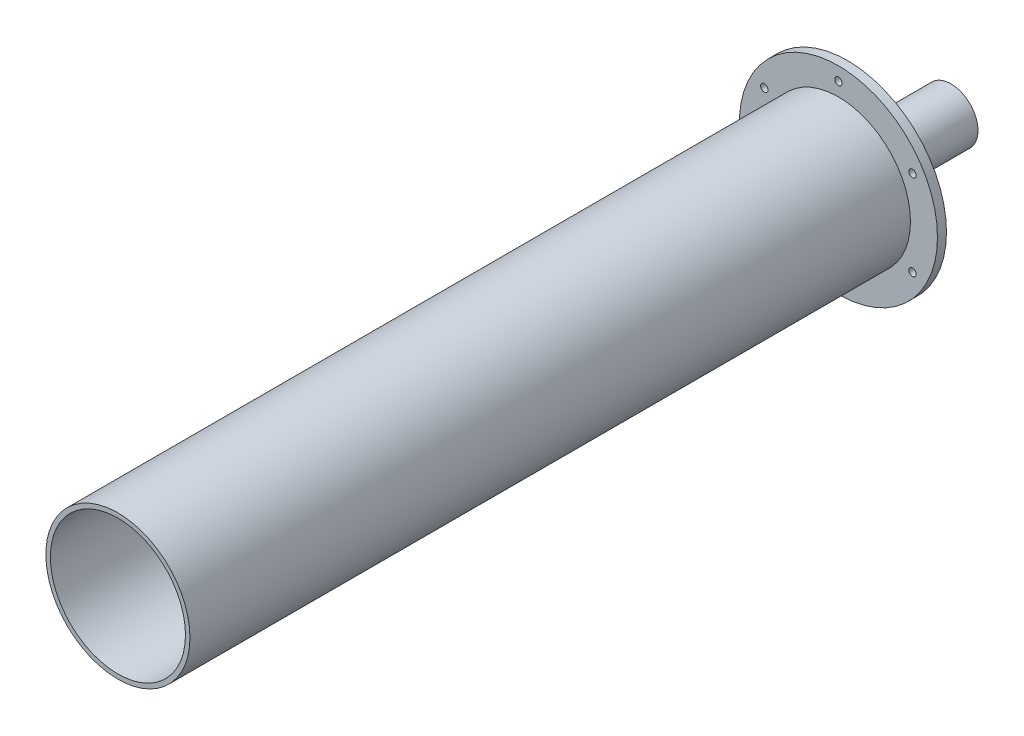
ISO-10303-21;
HEADER;
FILE_DESCRIPTION(('STEP AP214'),'2;1');
FILE_NAME('part.step','',(''),(''),'','','');
FILE_SCHEMA(('AUTOMOTIVE_DESIGN { 1 0 10303 214 1 1 1 1 }'));
ENDSEC;
DATA;
#1=APPLICATION_CONTEXT('core data for automotive mechanical design processes');
#2=APPLICATION_PROTOCOL_DEFINITION('international standard','automotive_design',2000,#1);
#3=PRODUCT_CONTEXT('',#1,'mechanical');
#4=PRODUCT('Part','Part','',(#3));
#5=PRODUCT_RELATED_PRODUCT_CATEGORY('part','',(#4));
#6=PRODUCT_DEFINITION_FORMATION('','',#4);
#7=PRODUCT_DEFINITION_CONTEXT('part definition',#1,'design');
#8=PRODUCT_DEFINITION('design','',#6,#7);
#9=PRODUCT_DEFINITION_SHAPE('','',#8);
#10=(LENGTH_UNIT() NAMED_UNIT(*) SI_UNIT(.MILLI.,.METRE.));
#11=(NAMED_UNIT(*) PLANE_ANGLE_UNIT() SI_UNIT($,.RADIAN.));
#12=(NAMED_UNIT(*) SI_UNIT($,.STERADIAN.) SOLID_ANGLE_UNIT());
#13=UNCERTAINTY_MEASURE_WITH_UNIT(LENGTH_MEASURE(1.E-05),#10,'distance_accuracy_value','');
#14=(GEOMETRIC_REPRESENTATION_CONTEXT(3) GLOBAL_UNCERTAINTY_ASSIGNED_CONTEXT((#13)) GLOBAL_UNIT_ASSIGNED_CONTEXT((#10,
#11,#12)) REPRESENTATION_CONTEXT('',''));
#15=CARTESIAN_POINT('',(0.,0.,0.));
#16=DIRECTION('',(0.,0.,1.));
#17=DIRECTION('',(1.,0.,0.));
#18=AXIS2_PLACEMENT_3D('',#15,#16,#17);
#19=CARTESIAN_POINT('',(0.,-153.811421356237,0.));
#20=DIRECTION('',(0.,0.,1.));
#21=DIRECTION('',(1.,0.,0.));
#22=AXIS2_PLACEMENT_3D('',#19,#20,#21);
#23=PLANE('',#22);
#24=CARTESIAN_POINT('',(-52.2429824832965,-30.1624999999995,0.));
#25=DIRECTION('',(0.,0.,1.));
#26=DIRECTION('',(-0.499999999999992,0.866025403784443,0.));
#27=AXIS2_PLACEMENT_3D('',#24,#25,#26);
#28=CIRCLE('',#27,2.5796875);
#29=CARTESIAN_POINT('',(-53.5328262332965,-27.9284250911743,0.));
#30=VERTEX_POINT('',#29);
#31=EDGE_CURVE('E432',#30,#30,#28,.T.);
#32=ORIENTED_EDGE('',*,*,#31,.T.);
#33=EDGE_LOOP('',(#32));
#34=FACE_BOUND('',#33,.T.);
#35=CARTESIAN_POINT('',(52.2429824832961,-30.1625000000002,0.));
#36=DIRECTION('',(0.,0.,1.));
#37=DIRECTION('',(-0.500000000000004,-0.866025403784436,0.));
#38=AXIS2_PLACEMENT_3D('',#35,#36,#37);
#39=CIRCLE('',#38,2.5796875);
#40=CARTESIAN_POINT('',(50.9531387332961,-32.3965749088254,0.));
#41=VERTEX_POINT('',#40);
#42=EDGE_CURVE('E420',#41,#41,#39,.T.);
#43=ORIENTED_EDGE('',*,*,#42,.T.);
#44=EDGE_LOOP('',(#43));
#45=FACE_BOUND('',#44,.T.);
#46=CARTESIAN_POINT('',(0.,60.325,0.));
#47=DIRECTION('',(0.,0.,1.));
#48=DIRECTION('',(1.,0.,0.));
#49=AXIS2_PLACEMENT_3D('',#46,#47,#48);
#50=CIRCLE('',#49,2.5796875);
#51=CARTESIAN_POINT('',(2.5796875,60.325,0.));
#52=VERTEX_POINT('',#51);
#53=EDGE_CURVE('E408',#52,#52,#50,.T.);
#54=ORIENTED_EDGE('',*,*,#53,.T.);
#55=EDGE_LOOP('',(#54));
#56=FACE_BOUND('',#55,.T.);
#57=CARTESIAN_POINT('',(0.,0.,0.));
#58=DIRECTION('',(0.,0.,1.));
#59=DIRECTION('',(1.,0.,0.));
#60=AXIS2_PLACEMENT_3D('',#57,#58,#59);
#61=CIRCLE('',#60,69.85);
#62=CARTESIAN_POINT('',(69.85,0.,0.));
#63=VERTEX_POINT('',#62);
#64=EDGE_CURVE('E390',#63,#63,#61,.T.);
#65=ORIENTED_EDGE('',*,*,#64,.F.);
#66=EDGE_LOOP('',(#65));
#67=FACE_BOUND('',#66,.T.);
#68=CARTESIAN_POINT('',(0.,0.,0.));
#69=DIRECTION('',(0.,0.,1.));
#70=DIRECTION('',(1.,0.,0.));
#71=AXIS2_PLACEMENT_3D('',#68,#69,#70);
#72=CIRCLE('',#71,50.8);
#73=CARTESIAN_POINT('',(50.8,0.,0.));
#74=VERTEX_POINT('',#73);
#75=EDGE_CURVE('E399',#74,#74,#72,.T.);
#76=ORIENTED_EDGE('',*,*,#75,.T.);
#77=EDGE_LOOP('',(#76));
#78=FACE_BOUND('',#77,.T.);
#79=CARTESIAN_POINT('',(52.2429824832963,30.1624999999999,0.));
#80=DIRECTION('',(0.,0.,1.));
#81=DIRECTION('',(0.499999999999998,-0.86602540378444,0.));
#82=AXIS2_PLACEMENT_3D('',#79,#80,#81);
#83=CIRCLE('',#82,2.5796875);
#84=CARTESIAN_POINT('',(53.5328262332963,27.9284250911747,0.));
#85=VERTEX_POINT('',#84);
#86=EDGE_CURVE('E414',#85,#85,#83,.T.);
#87=ORIENTED_EDGE('',*,*,#86,.T.);
#88=EDGE_LOOP('',(#87));
#89=FACE_BOUND('',#88,.T.);
#90=CARTESIAN_POINT('',(-4.21247467517847E-13,-60.325,0.));
#91=DIRECTION('',(0.,0.,1.));
#92=DIRECTION('',(-1.,0.,0.));
#93=AXIS2_PLACEMENT_3D('',#90,#91,#92);
#94=CIRCLE('',#93,2.5796875);
#95=CARTESIAN_POINT('',(-2.57968750000042,-60.325,0.));
#96=VERTEX_POINT('',#95);
#97=EDGE_CURVE('E426',#96,#96,#94,.T.);
#98=ORIENTED_EDGE('',*,*,#97,.T.);
#99=EDGE_LOOP('',(#98));
#100=FACE_BOUND('',#99,.T.);
#101=CARTESIAN_POINT('',(-52.2429824832959,30.1625000000006,0.));
#102=DIRECTION('',(0.,0.,1.));
#103=DIRECTION('',(0.50000000000001,0.866025403784433,0.));
#104=AXIS2_PLACEMENT_3D('',#101,#102,#103);
#105=CIRCLE('',#104,2.5796875);
#106=CARTESIAN_POINT('',(-50.9531387332959,32.3965749088258,0.));
#107=VERTEX_POINT('',#106);
#108=EDGE_CURVE('E438',#107,#107,#105,.T.);
#109=ORIENTED_EDGE('',*,*,#108,.T.);
#110=EDGE_LOOP('',(#109));
#111=FACE_BOUND('',#110,.T.);
#112=ADVANCED_FACE('F364',(#34,#45,#56,#67,#78,#89,#100,#111),#23,.F.);
#113=CARTESIAN_POINT('',(0.,-153.811421356237,6.35));
#114=DIRECTION('',(0.,0.,1.));
#115=DIRECTION('',(1.,0.,0.));
#116=AXIS2_PLACEMENT_3D('',#113,#114,#115);
#117=PLANE('',#116);
#118=CARTESIAN_POINT('',(-52.2429824832965,-30.1624999999995,6.35));
#119=DIRECTION('',(0.,0.,1.));
#120=DIRECTION('',(1.,0.,0.));
#121=AXIS2_PLACEMENT_3D('',#118,#119,#120);
#122=CIRCLE('',#121,2.5796875);
#123=CARTESIAN_POINT('',(-49.6632949832965,-30.1624999999995,6.35));
#124=VERTEX_POINT('',#123);
#125=EDGE_CURVE('E429',#124,#124,#122,.T.);
#126=ORIENTED_EDGE('',*,*,#125,.F.);
#127=EDGE_LOOP('',(#126));
#128=FACE_BOUND('',#127,.T.);
#129=CARTESIAN_POINT('',(52.2429824832961,-30.1625000000002,6.35));
#130=DIRECTION('',(0.,0.,1.));
#131=DIRECTION('',(1.,0.,0.));
#132=AXIS2_PLACEMENT_3D('',#129,#130,#131);
#133=CIRCLE('',#132,2.5796875);
#134=CARTESIAN_POINT('',(54.8226699832961,-30.1625000000002,6.35));
#135=VERTEX_POINT('',#134);
#136=EDGE_CURVE('E417',#135,#135,#133,.T.);
#137=ORIENTED_EDGE('',*,*,#136,.F.);
#138=EDGE_LOOP('',(#137));
#139=FACE_BOUND('',#138,.T.);
#140=CARTESIAN_POINT('',(0.,60.325,6.35));
#141=DIRECTION('',(0.,0.,1.));
#142=DIRECTION('',(1.,0.,0.));
#143=AXIS2_PLACEMENT_3D('',#140,#141,#142);
#144=CIRCLE('',#143,2.5796875);
#145=CARTESIAN_POINT('',(2.5796875,60.325,6.35));
#146=VERTEX_POINT('',#145);
#147=EDGE_CURVE('E405',#146,#146,#144,.T.);
#148=ORIENTED_EDGE('',*,*,#147,.F.);
#149=EDGE_LOOP('',(#148));
#150=FACE_BOUND('',#149,.T.);
#151=CARTESIAN_POINT('',(0.,0.,6.35));
#152=DIRECTION('',(0.,0.,1.));
#153=DIRECTION('',(1.,0.,0.));
#154=AXIS2_PLACEMENT_3D('',#151,#152,#153);
#155=CIRCLE('',#154,50.8);
#156=CARTESIAN_POINT('',(50.8,0.,6.35));
#157=VERTEX_POINT('',#156);
#158=EDGE_CURVE('E387',#157,#157,#155,.T.);
#159=ORIENTED_EDGE('',*,*,#158,.F.);
#160=EDGE_LOOP('',(#159));
#161=FACE_BOUND('',#160,.T.);
#162=CARTESIAN_POINT('',(0.,0.,6.35));
#163=DIRECTION('',(0.,0.,1.));
#164=DIRECTION('',(1.,0.,0.));
#165=AXIS2_PLACEMENT_3D('',#162,#163,#164);
#166=CIRCLE('',#165,69.85);
#167=CARTESIAN_POINT('',(69.85,0.,6.35));
#168=VERTEX_POINT('',#167);
#169=EDGE_CURVE('E384',#168,#168,#166,.T.);
#170=ORIENTED_EDGE('',*,*,#169,.T.);
#171=EDGE_LOOP('',(#170));
#172=FACE_BOUND('',#171,.T.);
#173=CARTESIAN_POINT('',(52.2429824832963,30.1624999999999,6.35));
#174=DIRECTION('',(0.,0.,1.));
#175=DIRECTION('',(1.,0.,0.));
#176=AXIS2_PLACEMENT_3D('',#173,#174,#175);
#177=CIRCLE('',#176,2.5796875);
#178=CARTESIAN_POINT('',(54.8226699832963,30.1624999999999,6.35));
#179=VERTEX_POINT('',#178);
#180=EDGE_CURVE('E411',#179,#179,#177,.T.);
#181=ORIENTED_EDGE('',*,*,#180,.F.);
#182=EDGE_LOOP('',(#181));
#183=FACE_BOUND('',#182,.T.);
#184=CARTESIAN_POINT('',(-4.21247467517847E-13,-60.325,6.35));
#185=DIRECTION('',(0.,0.,1.));
#186=DIRECTION('',(1.,0.,0.));
#187=AXIS2_PLACEMENT_3D('',#184,#185,#186);
#188=CIRCLE('',#187,2.5796875);
#189=CARTESIAN_POINT('',(2.57968749999958,-60.325,6.35));
#190=VERTEX_POINT('',#189);
#191=EDGE_CURVE('E423',#190,#190,#188,.T.);
#192=ORIENTED_EDGE('',*,*,#191,.F.);
#193=EDGE_LOOP('',(#192));
#194=FACE_BOUND('',#193,.T.);
#195=CARTESIAN_POINT('',(-52.2429824832959,30.1625000000006,6.35));
#196=DIRECTION('',(0.,0.,1.));
#197=DIRECTION('',(1.,0.,0.));
#198=AXIS2_PLACEMENT_3D('',#195,#196,#197);
#199=CIRCLE('',#198,2.5796875);
#200=CARTESIAN_POINT('',(-49.6632949832959,30.1625000000006,6.35));
#201=VERTEX_POINT('',#200);
#202=EDGE_CURVE('E435',#201,#201,#199,.T.);
#203=ORIENTED_EDGE('',*,*,#202,.F.);
#204=EDGE_LOOP('',(#203));
#205=FACE_BOUND('',#204,.T.);
#206=ADVANCED_FACE('F470',(#128,#139,#150,#161,#172,#183,#194,#205),#117,.T.);
#207=CARTESIAN_POINT('',(0.,0.,-73.025));
#208=DIRECTION('',(0.,0.,1.));
#209=DIRECTION('',(1.,0.,0.));
#210=AXIS2_PLACEMENT_3D('',#207,#208,#209);
#211=CYLINDRICAL_SURFACE('',#210,19.05);
#212=CARTESIAN_POINT('',(0.,0.,-73.025));
#213=DIRECTION('',(0.,0.,1.));
#214=DIRECTION('',(1.,0.,0.));
#215=AXIS2_PLACEMENT_3D('',#212,#213,#214);
#216=CIRCLE('',#215,19.05);
#217=CARTESIAN_POINT('',(19.05,0.,-73.025));
#218=VERTEX_POINT('',#217);
#219=EDGE_CURVE('E11',#218,#218,#216,.T.);
#220=ORIENTED_EDGE('',*,*,#219,.T.);
#221=EDGE_LOOP('',(#220));
#222=FACE_BOUND('',#221,.T.);
#223=CARTESIAN_POINT('',(0.,0.,0.));
#224=DIRECTION('',(0.,0.,1.));
#225=DIRECTION('',(1.,0.,0.));
#226=AXIS2_PLACEMENT_3D('',#223,#224,#225);
#227=CIRCLE('',#226,19.05);
#228=CARTESIAN_POINT('',(19.05,0.,0.));
#229=VERTEX_POINT('',#228);
#230=EDGE_CURVE('E379',#229,#229,#227,.T.);
#231=ORIENTED_EDGE('',*,*,#230,.F.);
#232=EDGE_LOOP('',(#231));
#233=FACE_BOUND('',#232,.T.);
#234=ADVANCED_FACE('F478',(#222,#233),#211,.T.);
#235=CARTESIAN_POINT('',(0.,0.,-73.025));
#236=DIRECTION('',(0.,0.,1.));
#237=DIRECTION('',(1.,0.,0.));
#238=AXIS2_PLACEMENT_3D('',#235,#236,#237);
#239=CYLINDRICAL_SURFACE('',#238,15.875);
#240=CARTESIAN_POINT('',(0.,0.,-73.025));
#241=DIRECTION('',(0.,0.,1.));
#242=DIRECTION('',(1.,0.,0.));
#243=AXIS2_PLACEMENT_3D('',#240,#241,#242);
#244=CIRCLE('',#243,15.875);
#245=CARTESIAN_POINT('',(15.875,0.,-73.025));
#246=VERTEX_POINT('',#245);
#247=EDGE_CURVE('E371',#246,#246,#244,.T.);
#248=ORIENTED_EDGE('',*,*,#247,.F.);
#249=EDGE_LOOP('',(#248));
#250=FACE_BOUND('',#249,.T.);
#251=CARTESIAN_POINT('',(0.,0.,6.35));
#252=DIRECTION('',(0.,0.,1.));
#253=DIRECTION('',(1.,0.,0.));
#254=AXIS2_PLACEMENT_3D('',#251,#252,#253);
#255=CIRCLE('',#254,15.875);
#256=CARTESIAN_POINT('',(15.875,0.,6.35));
#257=VERTEX_POINT('',#256);
#258=EDGE_CURVE('E375',#257,#257,#255,.T.);
#259=ORIENTED_EDGE('',*,*,#258,.T.);
#260=EDGE_LOOP('',(#259));
#261=FACE_BOUND('',#260,.T.);
#262=ADVANCED_FACE('F366',(#250,#261),#239,.F.);
#263=CARTESIAN_POINT('',(0.,-153.811421356237,-73.025));
#264=DIRECTION('',(0.,0.,1.));
#265=DIRECTION('',(1.,0.,0.));
#266=AXIS2_PLACEMENT_3D('',#263,#264,#265);
#267=PLANE('',#266);
#268=ORIENTED_EDGE('',*,*,#247,.T.);
#269=EDGE_LOOP('',(#268));
#270=FACE_BOUND('',#269,.T.);
#271=ORIENTED_EDGE('',*,*,#219,.F.);
#272=EDGE_LOOP('',(#271));
#273=FACE_BOUND('',#272,.T.);
#274=ADVANCED_FACE('F495',(#270,#273),#267,.F.);
#275=CARTESIAN_POINT('',(0.,-153.811421356237,6.35));
#276=DIRECTION('',(0.,0.,1.));
#277=DIRECTION('',(1.,0.,0.));
#278=AXIS2_PLACEMENT_3D('',#275,#276,#277);
#279=PLANE('',#278);
#280=ORIENTED_EDGE('',*,*,#258,.F.);
#281=EDGE_LOOP('',(#280));
#282=FACE_BOUND('',#281,.T.);
#283=CARTESIAN_POINT('',(0.,0.,6.34999999999997));
#284=DIRECTION('',(0.,0.,1.));
#285=DIRECTION('',(1.,0.,0.));
#286=AXIS2_PLACEMENT_3D('',#283,#284,#285);
#287=CIRCLE('',#286,47.625);
#288=CARTESIAN_POINT('',(47.625,0.,6.34999999999997));
#289=VERTEX_POINT('',#288);
#290=EDGE_CURVE('E441',#289,#289,#287,.F.);
#291=ORIENTED_EDGE('',*,*,#290,.F.);
#292=EDGE_LOOP('',(#291));
#293=FACE_BOUND('',#292,.T.);
#294=ADVANCED_FACE('F486',(#282,#293),#279,.T.);
#295=CARTESIAN_POINT('',(0.,0.,0.));
#296=DIRECTION('',(0.,0.,1.));
#297=DIRECTION('',(1.,0.,0.));
#298=AXIS2_PLACEMENT_3D('',#295,#296,#297);
#299=CIRCLE('',#298,47.625);
#300=CARTESIAN_POINT('',(47.625,0.,0.));
#301=VERTEX_POINT('',#300);
#302=EDGE_CURVE('E402',#301,#301,#299,.T.);
#303=ORIENTED_EDGE('',*,*,#302,.F.);
#304=EDGE_LOOP('',(#303));
#305=FACE_BOUND('',#304,.T.);
#306=ORIENTED_EDGE('',*,*,#230,.T.);
#307=EDGE_LOOP('',(#306));
#308=FACE_BOUND('',#307,.T.);
#309=ADVANCED_FACE('F473',(#305,#308),#23,.F.);
#310=CARTESIAN_POINT('',(0.,0.,6.35));
#311=DIRECTION('',(0.,0.,-1.));
#312=DIRECTION('',(-1.,0.,0.));
#313=AXIS2_PLACEMENT_3D('',#310,#311,#312);
#314=CYLINDRICAL_SURFACE('',#313,69.85);
#315=ORIENTED_EDGE('',*,*,#169,.F.);
#316=EDGE_LOOP('',(#315));
#317=FACE_BOUND('',#316,.T.);
#318=ORIENTED_EDGE('',*,*,#64,.T.);
#319=EDGE_LOOP('',(#318));
#320=FACE_BOUND('',#319,.T.);
#321=ADVANCED_FACE('F485',(#317,#320),#314,.T.);
#322=CARTESIAN_POINT('',(0.,0.,1.651));
#323=DIRECTION('',(0.,0.,-1.));
#324=DIRECTION('',(-1.,0.,0.));
#325=AXIS2_PLACEMENT_3D('',#322,#323,#324);
#326=CYLINDRICAL_SURFACE('',#325,47.625);
#327=CARTESIAN_POINT('',(0.,0.,1.651));
#328=DIRECTION('',(0.,0.,1.));
#329=DIRECTION('',(1.,0.,0.));
#330=AXIS2_PLACEMENT_3D('',#327,#328,#329);
#331=CIRCLE('',#330,47.625);
#332=CARTESIAN_POINT('',(47.625,0.,1.651));
#333=VERTEX_POINT('',#332);
#334=EDGE_CURVE('E396',#333,#333,#331,.T.);
#335=ORIENTED_EDGE('',*,*,#334,.F.);
#336=EDGE_LOOP('',(#335));
#337=FACE_BOUND('',#336,.T.);
#338=ORIENTED_EDGE('',*,*,#302,.T.);
#339=EDGE_LOOP('',(#338));
#340=FACE_BOUND('',#339,.T.);
#341=ADVANCED_FACE('F492',(#337,#340),#326,.T.);
#342=CARTESIAN_POINT('',(0.,0.,1.651));
#343=DIRECTION('',(0.,0.,-1.));
#344=DIRECTION('',(-1.,0.,0.));
#345=AXIS2_PLACEMENT_3D('',#342,#343,#344);
#346=CYLINDRICAL_SURFACE('',#345,50.8);
#347=CARTESIAN_POINT('',(0.,0.,1.651));
#348=DIRECTION('',(0.,0.,1.));
#349=DIRECTION('',(1.,0.,0.));
#350=AXIS2_PLACEMENT_3D('',#347,#348,#349);
#351=CIRCLE('',#350,50.8);
#352=CARTESIAN_POINT('',(50.8,0.,1.651));
#353=VERTEX_POINT('',#352);
#354=EDGE_CURVE('E393',#353,#353,#351,.T.);
#355=ORIENTED_EDGE('',*,*,#354,.T.);
#356=EDGE_LOOP('',(#355));
#357=FACE_BOUND('',#356,.T.);
#358=ORIENTED_EDGE('',*,*,#75,.F.);
#359=EDGE_LOOP('',(#358));
#360=FACE_BOUND('',#359,.T.);
#361=ADVANCED_FACE('F542',(#357,#360),#346,.F.);
#362=CARTESIAN_POINT('',(0.,-153.811421356237,1.651));
#363=DIRECTION('',(0.,0.,1.));
#364=DIRECTION('',(1.,0.,0.));
#365=AXIS2_PLACEMENT_3D('',#362,#363,#364);
#366=PLANE('',#365);
#367=ORIENTED_EDGE('',*,*,#334,.T.);
#368=EDGE_LOOP('',(#367));
#369=FACE_BOUND('',#368,.T.);
#370=ORIENTED_EDGE('',*,*,#354,.F.);
#371=EDGE_LOOP('',(#370));
#372=FACE_BOUND('',#371,.T.);
#373=ADVANCED_FACE('F550',(#369,#372),#366,.F.);
#374=CARTESIAN_POINT('',(0.,60.325,19.9964580983687));
#375=DIRECTION('',(0.,0.,-1.));
#376=DIRECTION('',(-1.,0.,0.));
#377=AXIS2_PLACEMENT_3D('',#374,#375,#376);
#378=CYLINDRICAL_SURFACE('',#377,2.5796875);
#379=ORIENTED_EDGE('',*,*,#53,.F.);
#380=EDGE_LOOP('',(#379));
#381=FACE_BOUND('',#380,.T.);
#382=ORIENTED_EDGE('',*,*,#147,.T.);
#383=EDGE_LOOP('',(#382));
#384=FACE_BOUND('',#383,.T.);
#385=ADVANCED_FACE('F558',(#381,#384),#378,.F.);
#386=CARTESIAN_POINT('',(52.2429824832963,30.1624999999999,19.9964580983687));
#387=DIRECTION('',(0.,0.,-1.));
#388=DIRECTION('',(-1.,0.,0.));
#389=AXIS2_PLACEMENT_3D('',#386,#387,#388);
#390=CYLINDRICAL_SURFACE('',#389,2.5796875);
#391=ORIENTED_EDGE('',*,*,#86,.F.);
#392=EDGE_LOOP('',(#391));
#393=FACE_BOUND('',#392,.T.);
#394=ORIENTED_EDGE('',*,*,#180,.T.);
#395=EDGE_LOOP('',(#394));
#396=FACE_BOUND('',#395,.T.);
#397=ADVANCED_FACE('F565',(#393,#396),#390,.F.);
#398=CARTESIAN_POINT('',(52.2429824832961,-30.1625000000002,19.9964580983687));
#399=DIRECTION('',(0.,0.,-1.));
#400=DIRECTION('',(-1.,0.,0.));
#401=AXIS2_PLACEMENT_3D('',#398,#399,#400);
#402=CYLINDRICAL_SURFACE('',#401,2.5796875);
#403=ORIENTED_EDGE('',*,*,#42,.F.);
#404=EDGE_LOOP('',(#403));
#405=FACE_BOUND('',#404,.T.);
#406=ORIENTED_EDGE('',*,*,#136,.T.);
#407=EDGE_LOOP('',(#406));
#408=FACE_BOUND('',#407,.T.);
#409=ADVANCED_FACE('F591',(#405,#408),#402,.F.);
#410=CARTESIAN_POINT('',(-4.21247467517847E-13,-60.325,19.9964580983687));
#411=DIRECTION('',(0.,0.,-1.));
#412=DIRECTION('',(-1.,0.,0.));
#413=AXIS2_PLACEMENT_3D('',#410,#411,#412);
#414=CYLINDRICAL_SURFACE('',#413,2.5796875);
#415=ORIENTED_EDGE('',*,*,#97,.F.);
#416=EDGE_LOOP('',(#415));
#417=FACE_BOUND('',#416,.T.);
#418=ORIENTED_EDGE('',*,*,#191,.T.);
#419=EDGE_LOOP('',(#418));
#420=FACE_BOUND('',#419,.T.);
#421=ADVANCED_FACE('F599',(#417,#420),#414,.F.);
#422=CARTESIAN_POINT('',(-52.2429824832965,-30.1624999999995,19.9964580983687));
#423=DIRECTION('',(0.,0.,-1.));
#424=DIRECTION('',(-1.,0.,0.));
#425=AXIS2_PLACEMENT_3D('',#422,#423,#424);
#426=CYLINDRICAL_SURFACE('',#425,2.5796875);
#427=ORIENTED_EDGE('',*,*,#31,.F.);
#428=EDGE_LOOP('',(#427));
#429=FACE_BOUND('',#428,.T.);
#430=ORIENTED_EDGE('',*,*,#125,.T.);
#431=EDGE_LOOP('',(#430));
#432=FACE_BOUND('',#431,.T.);
#433=ADVANCED_FACE('F465',(#429,#432),#426,.F.);
#434=CARTESIAN_POINT('',(-52.2429824832959,30.1625000000006,19.9964580983687));
#435=DIRECTION('',(0.,0.,-1.));
#436=DIRECTION('',(-1.,0.,0.));
#437=AXIS2_PLACEMENT_3D('',#434,#435,#436);
#438=CYLINDRICAL_SURFACE('',#437,2.5796875);
#439=ORIENTED_EDGE('',*,*,#108,.F.);
#440=EDGE_LOOP('',(#439));
#441=FACE_BOUND('',#440,.T.);
#442=ORIENTED_EDGE('',*,*,#202,.T.);
#443=EDGE_LOOP('',(#442));
#444=FACE_BOUND('',#443,.T.);
#445=ADVANCED_FACE('F456',(#441,#444),#438,.F.);
#446=CARTESIAN_POINT('',(0.,0.,514.35));
#447=DIRECTION('',(0.,0.,1.));
#448=DIRECTION('',(1.,0.,0.));
#449=AXIS2_PLACEMENT_3D('',#446,#447,#448);
#450=PLANE('',#449);
#451=CARTESIAN_POINT('',(0.,0.,514.35));
#452=DIRECTION('',(0.,0.,1.));
#453=DIRECTION('',(1.,0.,0.));
#454=AXIS2_PLACEMENT_3D('',#451,#452,#453);
#455=CIRCLE('',#454,50.8);
#456=CARTESIAN_POINT('',(50.8,0.,514.35));
#457=VERTEX_POINT('',#456);
#458=EDGE_CURVE('E444',#457,#457,#455,.T.);
#459=ORIENTED_EDGE('',*,*,#458,.T.);
#460=EDGE_LOOP('',(#459));
#461=FACE_BOUND('',#460,.T.);
#462=CARTESIAN_POINT('',(0.,0.,514.35));
#463=DIRECTION('',(0.,0.,1.));
#464=DIRECTION('',(1.,0.,0.));
#465=AXIS2_PLACEMENT_3D('',#462,#463,#464);
#466=CIRCLE('',#465,47.625);
#467=CARTESIAN_POINT('',(47.625,0.,514.35));
#468=VERTEX_POINT('',#467);
#469=EDGE_CURVE('E447',#468,#468,#466,.T.);
#470=ORIENTED_EDGE('',*,*,#469,.F.);
#471=EDGE_LOOP('',(#470));
#472=FACE_BOUND('',#471,.T.);
#473=ADVANCED_FACE('F453',(#461,#472),#450,.T.);
#474=CARTESIAN_POINT('',(0.,0.,514.35));
#475=DIRECTION('',(0.,0.,-1.));
#476=DIRECTION('',(-1.,0.,0.));
#477=AXIS2_PLACEMENT_3D('',#474,#475,#476);
#478=CYLINDRICAL_SURFACE('',#477,50.8);
#479=ORIENTED_EDGE('',*,*,#158,.T.);
#480=EDGE_LOOP('',(#479));
#481=FACE_BOUND('',#480,.T.);
#482=ORIENTED_EDGE('',*,*,#458,.F.);
#483=EDGE_LOOP('',(#482));
#484=FACE_BOUND('',#483,.T.);
#485=ADVANCED_FACE('F455',(#481,#484),#478,.T.);
#486=CARTESIAN_POINT('',(0.,0.,514.35));
#487=DIRECTION('',(0.,0.,-1.));
#488=DIRECTION('',(-1.,0.,0.));
#489=AXIS2_PLACEMENT_3D('',#486,#487,#488);
#490=CYLINDRICAL_SURFACE('',#489,47.625);
#491=ORIENTED_EDGE('',*,*,#290,.T.);
#492=EDGE_LOOP('',(#491));
#493=FACE_BOUND('',#492,.T.);
#494=ORIENTED_EDGE('',*,*,#469,.T.);
#495=EDGE_LOOP('',(#494));
#496=FACE_BOUND('',#495,.T.);
#497=ADVANCED_FACE('F451',(#493,#496),#490,.F.);
#498=CLOSED_SHELL('',(#112,#206,#234,#262,#274,#294,#309,#321,#341,#361,#373,#385,#397,#409,
#421,#433,#445,#473,#485,#497));
#499=MANIFOLD_SOLID_BREP('B2',#498);
#500=ADVANCED_BREP_SHAPE_REPRESENTATION('',(#18,#499),#14);
#501=SHAPE_DEFINITION_REPRESENTATION(#9,#500);
ENDSEC;
END-ISO-10303-21;
